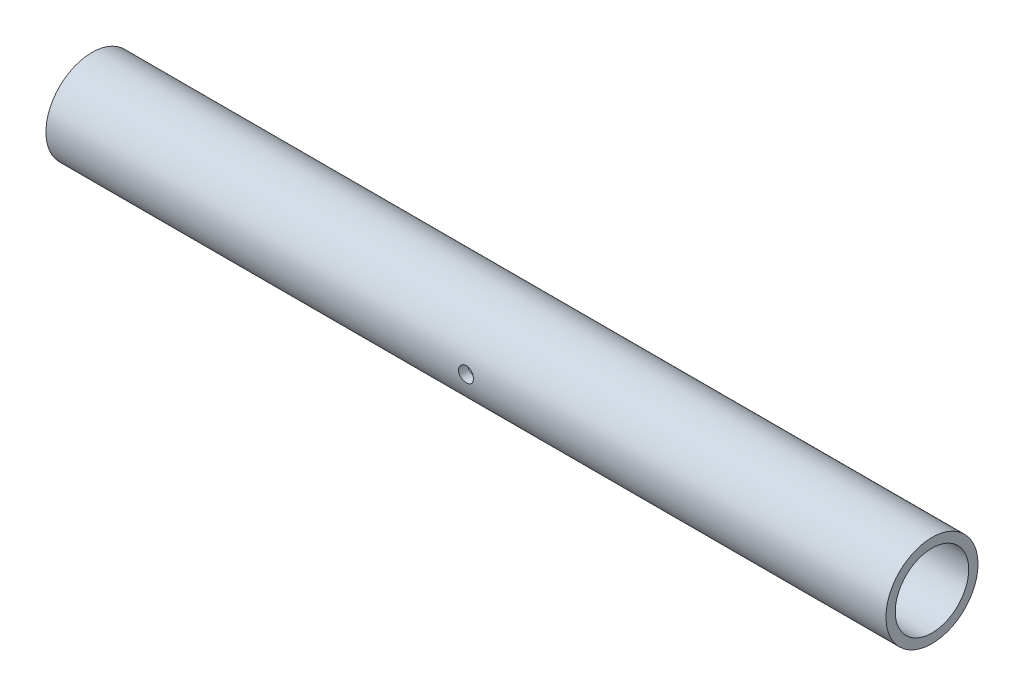
ISO-10303-21;
HEADER;
FILE_DESCRIPTION(('STEP AP214'),'2;1');
FILE_NAME('part.step','',(''),(''),'','','');
FILE_SCHEMA(('AUTOMOTIVE_DESIGN { 1 0 10303 214 1 1 1 1 }'));
ENDSEC;
DATA;
#1=APPLICATION_CONTEXT('core data for automotive mechanical design processes');
#2=APPLICATION_PROTOCOL_DEFINITION('international standard','automotive_design',2000,#1);
#3=PRODUCT_CONTEXT('',#1,'mechanical');
#4=PRODUCT('Part','Part','',(#3));
#5=PRODUCT_RELATED_PRODUCT_CATEGORY('part','',(#4));
#6=PRODUCT_DEFINITION_FORMATION('','',#4);
#7=PRODUCT_DEFINITION_CONTEXT('part definition',#1,'design');
#8=PRODUCT_DEFINITION('design','',#6,#7);
#9=PRODUCT_DEFINITION_SHAPE('','',#8);
#10=(LENGTH_UNIT() NAMED_UNIT(*) SI_UNIT(.MILLI.,.METRE.));
#11=(NAMED_UNIT(*) PLANE_ANGLE_UNIT() SI_UNIT($,.RADIAN.));
#12=(NAMED_UNIT(*) SI_UNIT($,.STERADIAN.) SOLID_ANGLE_UNIT());
#13=UNCERTAINTY_MEASURE_WITH_UNIT(LENGTH_MEASURE(1.E-05),#10,'distance_accuracy_value','');
#14=(GEOMETRIC_REPRESENTATION_CONTEXT(3) GLOBAL_UNCERTAINTY_ASSIGNED_CONTEXT((#13)) GLOBAL_UNIT_ASSIGNED_CONTEXT((#10,
#11,#12)) REPRESENTATION_CONTEXT('',''));
#15=CARTESIAN_POINT('',(0.,0.,0.));
#16=DIRECTION('',(0.,0.,1.));
#17=DIRECTION('',(1.,0.,0.));
#18=AXIS2_PLACEMENT_3D('',#15,#16,#17);
#19=CARTESIAN_POINT('',(304.8,0.,0.));
#20=DIRECTION('',(1.,0.,0.));
#21=DIRECTION('',(0.,0.,-1.));
#22=AXIS2_PLACEMENT_3D('',#19,#20,#21);
#23=PLANE('',#22);
#24=CARTESIAN_POINT('',(304.8,0.,0.));
#25=DIRECTION('',(1.,0.,0.));
#26=DIRECTION('',(0.,0.,-1.));
#27=AXIS2_PLACEMENT_3D('',#24,#25,#26);
#28=CIRCLE('',#27,16.7005);
#29=CARTESIAN_POINT('',(304.8,0.,-16.7005));
#30=VERTEX_POINT('',#29);
#31=EDGE_CURVE('E10',#30,#30,#28,.T.);
#32=ORIENTED_EDGE('',*,*,#31,.T.);
#33=EDGE_LOOP('',(#32));
#34=FACE_BOUND('',#33,.T.);
#35=CARTESIAN_POINT('',(304.8,0.,0.));
#36=DIRECTION('',(1.,0.,0.));
#37=DIRECTION('',(0.,0.,-1.));
#38=AXIS2_PLACEMENT_3D('',#35,#36,#37);
#39=CIRCLE('',#38,13.335);
#40=CARTESIAN_POINT('',(304.8,0.,-13.335));
#41=VERTEX_POINT('',#40);
#42=EDGE_CURVE('E45',#41,#41,#39,.T.);
#43=ORIENTED_EDGE('',*,*,#42,.F.);
#44=EDGE_LOOP('',(#43));
#45=FACE_BOUND('',#44,.T.);
#46=ADVANCED_FACE('F33',(#34,#45),#23,.T.);
#47=CARTESIAN_POINT('',(0.,0.,0.));
#48=DIRECTION('',(1.,0.,0.));
#49=DIRECTION('',(0.,0.,-1.));
#50=AXIS2_PLACEMENT_3D('',#47,#48,#49);
#51=PLANE('',#50);
#52=CARTESIAN_POINT('',(0.,0.,0.));
#53=DIRECTION('',(1.,0.,0.));
#54=DIRECTION('',(0.,0.,-1.));
#55=AXIS2_PLACEMENT_3D('',#52,#53,#54);
#56=CIRCLE('',#55,16.7005);
#57=CARTESIAN_POINT('',(0.,0.,-16.7005));
#58=VERTEX_POINT('',#57);
#59=EDGE_CURVE('E38',#58,#58,#56,.T.);
#60=ORIENTED_EDGE('',*,*,#59,.F.);
#61=EDGE_LOOP('',(#60));
#62=FACE_BOUND('',#61,.T.);
#63=CARTESIAN_POINT('',(0.,0.,0.));
#64=DIRECTION('',(1.,0.,0.));
#65=DIRECTION('',(0.,0.,-1.));
#66=AXIS2_PLACEMENT_3D('',#63,#64,#65);
#67=CIRCLE('',#66,13.335);
#68=CARTESIAN_POINT('',(0.,0.,-13.335));
#69=VERTEX_POINT('',#68);
#70=EDGE_CURVE('E47',#69,#69,#67,.T.);
#71=ORIENTED_EDGE('',*,*,#70,.T.);
#72=EDGE_LOOP('',(#71));
#73=FACE_BOUND('',#72,.T.);
#74=ADVANCED_FACE('F76',(#62,#73),#51,.F.);
#75=CARTESIAN_POINT('',(304.8,0.,0.));
#76=DIRECTION('',(-1.,0.,0.));
#77=DIRECTION('',(0.,0.,1.));
#78=AXIS2_PLACEMENT_3D('',#75,#76,#77);
#79=CYLINDRICAL_SURFACE('',#78,16.7005);
#80=CARTESIAN_POINT('',(155.1051,0.,16.7005));
#81=CARTESIAN_POINT('',(155.105093897087,-0.150888062548303,16.7004974577365));
#82=CARTESIAN_POINT('',(155.092432758379,-0.301859994666066,16.6984337641219));
#83=CARTESIAN_POINT('',(155.042141383676,-0.599573765303217,16.6903999723937));
#84=CARTESIAN_POINT('',(155.004487792628,-0.746311513080885,16.6844262204648));
#85=CARTESIAN_POINT('',(154.90537472287,-1.0312061766267,16.6692427211351));
#86=CARTESIAN_POINT('',(154.843934287842,-1.16936985436145,16.6600355629369));
#87=CARTESIAN_POINT('',(154.699040513581,-1.43340829062403,16.6393990707399));
#88=CARTESIAN_POINT('',(154.615589848481,-1.55928453946972,16.6279700067358));
#89=CARTESIAN_POINT('',(154.428240590823,-1.79633294529008,16.6040421740029));
#90=CARTESIAN_POINT('',(154.324181856033,-1.90737774983379,16.591535491026));
#91=CARTESIAN_POINT('',(154.098914989324,-2.1105114085896,16.5669229733114));
#92=CARTESIAN_POINT('',(153.977705804489,-2.20259909811607,16.5548171632407));
#93=CARTESIAN_POINT('',(153.720709403468,-2.36571066174806,16.5323003820462));
#94=CARTESIAN_POINT('',(153.58484178218,-2.43660938550688,16.521899638475));
#95=CARTESIAN_POINT('',(153.302929431016,-2.55453030416696,16.5040799174436));
#96=CARTESIAN_POINT('',(153.156885350204,-2.60155402025599,16.4966607500196));
#97=CARTESIAN_POINT('',(152.860112716242,-2.66999048982907,16.4857227198729));
#98=CARTESIAN_POINT('',(152.709435998324,-2.69162258951269,16.4821704723586));
#99=CARTESIAN_POINT('',(152.406552768084,-2.70934168919743,16.4792673895096));
#100=CARTESIAN_POINT('',(152.254346358719,-2.70543039707,16.4799162732805));
#101=CARTESIAN_POINT('',(151.954285356396,-2.67235257585698,16.4853116422221));
#102=CARTESIAN_POINT('',(151.806402847489,-2.64343183378623,16.4900182476923));
#103=CARTESIAN_POINT('',(151.517617291042,-2.56154150799834,16.502936357017));
#104=CARTESIAN_POINT('',(151.37671447089,-2.50857114134623,16.5111479749766));
#105=CARTESIAN_POINT('',(151.105148697648,-2.37983413536215,16.5301942305314));
#106=CARTESIAN_POINT('',(150.974535269656,-2.30396483733819,16.5410406365502));
#107=CARTESIAN_POINT('',(150.727800002518,-2.13165657059765,16.5641260861383));
#108=CARTESIAN_POINT('',(150.611679270523,-2.03521603188844,16.5763652359683));
#109=CARTESIAN_POINT('',(150.395802387933,-1.82316079178855,16.6010326457947));
#110=CARTESIAN_POINT('',(150.296253457762,-1.70733507940944,16.6134614436807));
#111=CARTESIAN_POINT('',(150.117973519348,-1.46051261763989,16.6369752748997));
#112=CARTESIAN_POINT('',(150.039242631801,-1.32951578029888,16.6480603004418));
#113=CARTESIAN_POINT('',(149.904817203808,-1.05587919110396,16.6676520858549));
#114=CARTESIAN_POINT('',(149.849140292661,-0.913230628642439,16.6761568713015));
#115=CARTESIAN_POINT('',(149.762592033457,-0.620439017931161,16.689613888894));
#116=CARTESIAN_POINT('',(149.731718726758,-0.470296562439258,16.6945664015455));
#117=CARTESIAN_POINT('',(149.695933402982,-0.16856590589134,16.7003233068798));
#118=CARTESIAN_POINT('',(149.690736794805,-0.0170122941565777,16.7011731693918));
#119=CARTESIAN_POINT('',(149.705694623299,0.284800682339517,16.6987533332108));
#120=CARTESIAN_POINT('',(149.725848140432,0.435060093846976,16.6954837839433));
#121=CARTESIAN_POINT('',(149.79069743882,0.729145269491143,16.6852206333956));
#122=CARTESIAN_POINT('',(149.835252978216,0.873002765566383,16.6782483193063));
#123=CARTESIAN_POINT('',(149.947492520573,1.15120604540566,16.6613584524574));
#124=CARTESIAN_POINT('',(150.015177761857,1.28555131943812,16.6514407420105));
#125=CARTESIAN_POINT('',(150.172411794106,1.54215720864201,16.629647987126));
#126=CARTESIAN_POINT('',(150.262139161391,1.66430704194941,16.6177572269374));
#127=CARTESIAN_POINT('',(150.460663902427,1.89191696449165,16.5933865628871));
#128=CARTESIAN_POINT('',(150.569462579924,1.99737591177163,16.5809066187905));
#129=CARTESIAN_POINT('',(150.804315231753,2.18965975513515,16.5566179523259));
#130=CARTESIAN_POINT('',(150.93052720777,2.27629280016818,16.5448169671038));
#131=CARTESIAN_POINT('',(151.195879626388,2.42712761732702,16.5233646792845));
#132=CARTESIAN_POINT('',(151.335019675855,2.49133007126879,16.5137133113492));
#133=CARTESIAN_POINT('',(151.62173175804,2.59519124980596,16.4977104952734));
#134=CARTESIAN_POINT('',(151.769267861794,2.6349470586088,16.4913460103877));
#135=CARTESIAN_POINT('',(152.069034939324,2.68909299931143,16.4826042915982));
#136=CARTESIAN_POINT('',(152.221265528669,2.70348520265564,16.4802267320832));
#137=CARTESIAN_POINT('',(152.524185617428,2.70644008511556,16.4797415544371));
#138=CARTESIAN_POINT('',(152.674872177798,2.69530464320214,16.4815840317318));
#139=CARTESIAN_POINT('',(152.972198053532,2.64817138492831,16.4892222214147));
#140=CARTESIAN_POINT('',(153.118837379963,2.61217363655834,16.4950179229922));
#141=CARTESIAN_POINT('',(153.403799112764,2.51645069874717,16.5098910068696));
#142=CARTESIAN_POINT('',(153.542129961818,2.45675008128221,16.5189649898099));
#143=CARTESIAN_POINT('',(153.806861126234,2.31534678208125,16.5393757512933));
#144=CARTESIAN_POINT('',(153.933260903651,2.23364310891717,16.5507126317935));
#145=CARTESIAN_POINT('',(154.172069631771,2.0494698849786,16.5745306822589));
#146=CARTESIAN_POINT('',(154.284305840065,1.94677779193518,16.5870232561983));
#147=CARTESIAN_POINT('',(154.490057277457,1.72401256578686,16.6116529092408));
#148=CARTESIAN_POINT('',(154.583568172536,1.60393541992531,16.6237899054911));
#149=CARTESIAN_POINT('',(154.749765732965,1.34888505958874,16.6464318057398));
#150=CARTESIAN_POINT('',(154.822313353884,1.21382025362174,16.6569256097812));
#151=CARTESIAN_POINT('',(154.943580335504,0.933308987477759,16.6749905845962));
#152=CARTESIAN_POINT('',(154.992323705429,0.787873158058099,16.6825646985689));
#153=CARTESIAN_POINT('',(155.053878589069,0.534871671086589,16.6922617563775));
#154=CARTESIAN_POINT('',(155.073056270392,0.428846028496355,16.6953347747841));
#155=CARTESIAN_POINT('',(155.098669052378,0.215227800139453,16.6994547874161));
#156=CARTESIAN_POINT('',(155.105104353482,0.107635239047601,16.7005018135109));
#157=CARTESIAN_POINT('',(155.1051,0.,16.7005));
#158=B_SPLINE_CURVE_WITH_KNOTS('',3,(#80,#81,#82,#83,#84,#85,#86,#87,#88,#89,#90,#91,#92,#93,
#94,#95,#96,#97,#98,#99,#100,#101,#102,#103,#104,#105,#106,#107,#108,#109,#110,#111,#112,#113,
#114,#115,#116,#117,#118,#119,#120,#121,#122,#123,#124,#125,#126,#127,#128,#129,#130,#131,#132,
#133,#134,#135,#136,#137,#138,#139,#140,#141,#142,#143,#144,#145,#146,#147,#148,#149,#150,#151,
#152,#153,#154,#155,#156,#157),.UNSPECIFIED.,.T.,.F.,(4,2,2,2,2,2,2,2,2,2,2,2,2,2,2,2,2,2,2,2,2,
2,2,2,2,2,2,2,2,2,2,2,2,2,2,2,2,2,4),(0.,0.452270787216408,0.904964810512096,1.35729715518357,
1.80957456901735,2.26551517452944,2.72148378372722,3.18009458772586,3.63867616782943,
4.09326642255645,4.54782628297365,4.9979689596137,5.44812629168908,5.90033249063431,
6.35257321421474,6.81010181368963,7.26763306569815,7.7255135470429,8.18335786781695,
8.63611604666351,9.08885780285638,9.53902448404456,9.98921527009213,10.4431811075173,
10.8971779909038,11.3556045004122,11.8140170740548,12.2705972081985,12.7271400517363,
13.1783119065942,13.6294825276468,14.0801866512621,14.5309110863978,14.9866887137601,
15.4425717103213,15.9014124875041,16.3597895122137,16.6824196742317,17.0050447611613),.UNSPECIFIED.);
#159=CARTESIAN_POINT('',(155.1051,0.,16.7005));
#160=VERTEX_POINT('',#159);
#161=EDGE_CURVE('E50',#160,#160,#158,.T.);
#162=ORIENTED_EDGE('',*,*,#161,.T.);
#163=EDGE_LOOP('',(#162));
#164=FACE_BOUND('',#163,.T.);
#165=ORIENTED_EDGE('',*,*,#31,.F.);
#166=EDGE_LOOP('',(#165));
#167=FACE_BOUND('',#166,.T.);
#168=ORIENTED_EDGE('',*,*,#59,.T.);
#169=EDGE_LOOP('',(#168));
#170=FACE_BOUND('',#169,.T.);
#171=ADVANCED_FACE('F35',(#164,#167,#170),#79,.T.);
#172=CARTESIAN_POINT('',(304.8,0.,0.));
#173=DIRECTION('',(-1.,0.,0.));
#174=DIRECTION('',(0.,0.,1.));
#175=AXIS2_PLACEMENT_3D('',#172,#173,#174);
#176=CYLINDRICAL_SURFACE('',#175,13.335);
#177=CARTESIAN_POINT('',(155.1051,0.,13.335));
#178=CARTESIAN_POINT('',(155.105094525376,-0.150295600484553,13.3349972242289));
#179=CARTESIAN_POINT('',(155.092532026992,-0.300659946654723,13.3324330403292));
#180=CARTESIAN_POINT('',(155.0426556573,-0.597135385188636,13.3224513830455));
#181=CARTESIAN_POINT('',(155.00532241314,-0.743243055026255,13.3150301110628));
#182=CARTESIAN_POINT('',(154.907107787482,-1.02687601225216,13.296162618508));
#183=CARTESIAN_POINT('',(154.84624926408,-1.16440948049959,13.2847203059164));
#184=CARTESIAN_POINT('',(154.702780252209,-1.4273047577558,13.2590533011895));
#185=CARTESIAN_POINT('',(154.620170950095,-1.55266723009767,13.2448287608163));
#186=CARTESIAN_POINT('',(154.434327195231,-1.7894149071107,13.2149405065597));
#187=CARTESIAN_POINT('',(154.330848481905,-1.9006064034824,13.199261063324));
#188=CARTESIAN_POINT('',(154.106728265231,-2.10417816613857,13.168344071895));
#189=CARTESIAN_POINT('',(153.986085396097,-2.19655693403454,13.1531065589832));
#190=CARTESIAN_POINT('',(153.729662382321,-2.36070988620932,13.1246448707219));
#191=CARTESIAN_POINT('',(153.593750860226,-2.43228266379821,13.1114409219455));
#192=CARTESIAN_POINT('',(153.311518766293,-2.55150142471515,13.0887651113974));
#193=CARTESIAN_POINT('',(153.165199255873,-2.59914984389556,13.0792928697041));
#194=CARTESIAN_POINT('',(152.868391357684,-2.6685367944566,13.0653122596412));
#195=CARTESIAN_POINT('',(152.717985662028,-2.69061565322798,13.0607387529412));
#196=CARTESIAN_POINT('',(152.415540625344,-2.70929399940926,13.0568774442569));
#197=CARTESIAN_POINT('',(152.263501457958,-2.70589616880503,13.0575890858936));
#198=CARTESIAN_POINT('',(151.964601070229,-2.67399255726,13.0641585153922));
#199=CARTESIAN_POINT('',(151.817696102583,-2.64587767366682,13.0699361809375));
#200=CARTESIAN_POINT('',(151.530732268451,-2.56595538643003,13.0858604269536));
#201=CARTESIAN_POINT('',(151.390673737762,-2.51414682197339,13.0960072214775));
#202=CARTESIAN_POINT('',(151.120256078371,-2.38793669722346,13.1196079166759));
#203=CARTESIAN_POINT('',(150.989970984035,-2.31338088418128,13.1330842731062));
#204=CARTESIAN_POINT('',(150.74361439873,-2.14390140848478,13.1618113260375));
#205=CARTESIAN_POINT('',(150.627544588842,-2.04897534051733,13.1770622319794));
#206=CARTESIAN_POINT('',(150.410658529072,-1.83936052489874,13.207966610656));
#207=CARTESIAN_POINT('',(150.310164588826,-1.72433832876226,13.2236223079897));
#208=CARTESIAN_POINT('',(150.129845547073,-1.47890259644831,13.2533138361505));
#209=CARTESIAN_POINT('',(150.050020725472,-1.34848885186894,13.2673496450393));
#210=CARTESIAN_POINT('',(149.913243309945,-1.07560877370192,13.2922559746792));
#211=CARTESIAN_POINT('',(149.856328351573,-0.9331230696536,13.3031212790442));
#212=CARTESIAN_POINT('',(149.767334173484,-0.640342655170266,13.3204229182029));
#213=CARTESIAN_POINT('',(149.735251857011,-0.490048920930976,13.3268598052313));
#214=CARTESIAN_POINT('',(149.697291809661,-0.188687712334038,13.3345021896925));
#215=CARTESIAN_POINT('',(149.69097311446,-0.037677946869132,13.3357957101814));
#216=CARTESIAN_POINT('',(149.703530978531,0.263239556156422,13.3332504287549));
#217=CARTESIAN_POINT('',(149.722406078805,0.413147357027401,13.32941192404));
#218=CARTESIAN_POINT('',(149.784449478553,0.706177355722136,13.3170890419464));
#219=CARTESIAN_POINT('',(149.827390777664,0.849349603396196,13.3086480961947));
#220=CARTESIAN_POINT('',(149.936098999973,1.12646132397948,13.2880635649464));
#221=CARTESIAN_POINT('',(150.001867669613,1.26040008952707,13.2759196961607));
#222=CARTESIAN_POINT('',(150.1553124641,1.51709720534946,13.249057435921));
#223=CARTESIAN_POINT('',(150.243253128819,1.63969417441024,13.234308651375));
#224=CARTESIAN_POINT('',(150.438192261469,1.86854925612131,13.2039425775509));
#225=CARTESIAN_POINT('',(150.545192835727,1.97480556053181,13.1883251924146));
#226=CARTESIAN_POINT('',(150.777224325758,2.16967113581846,13.1576842969314));
#227=CARTESIAN_POINT('',(150.902511858808,2.2579772780275,13.1426739537023));
#228=CARTESIAN_POINT('',(151.166400440108,2.41229295069217,13.1152291615274));
#229=CARTESIAN_POINT('',(151.305000947602,2.47830338628301,13.1027946080206));
#230=CARTESIAN_POINT('',(151.590874470357,2.58574384042946,13.0820163622959));
#231=CARTESIAN_POINT('',(151.738097250659,2.62730316903986,13.0736511905723));
#232=CARTESIAN_POINT('',(152.037624714809,2.68505210426675,13.0619142618958));
#233=CARTESIAN_POINT('',(152.189928711529,2.70124512705367,13.058541832556));
#234=CARTESIAN_POINT('',(152.492249983923,2.70767252503984,13.0572103103202));
#235=CARTESIAN_POINT('',(152.642256835453,2.69838611838186,13.0591512812084));
#236=CARTESIAN_POINT('',(152.938522306478,2.65517792546284,13.0680041721845));
#237=CARTESIAN_POINT('',(153.084780958013,2.62125634986901,13.0749160497637));
#238=CARTESIAN_POINT('',(153.369082210092,2.52995717578002,13.0928866727968));
#239=CARTESIAN_POINT('',(153.507144922099,2.47263996377305,13.1039347363055));
#240=CARTESIAN_POINT('',(153.771768617197,2.33623222267459,13.1289386922158));
#241=CARTESIAN_POINT('',(153.898328599311,2.25713980109381,13.1428948373339));
#242=CARTESIAN_POINT('',(154.138737028366,2.07779697949024,13.1724471666242));
#243=CARTESIAN_POINT('',(154.252324843556,1.97720115843756,13.188067738479));
#244=CARTESIAN_POINT('',(154.461166037052,1.75841835754841,13.2190155313656));
#245=CARTESIAN_POINT('',(154.556415194048,1.64022733861366,13.2343426841269));
#246=CARTESIAN_POINT('',(154.726850865077,1.38807123157175,13.2631724688158));
#247=CARTESIAN_POINT('',(154.801809092012,1.25394927014427,13.276653559364));
#248=CARTESIAN_POINT('',(154.928003538366,0.974774923026418,13.3000597177516));
#249=CARTESIAN_POINT('',(154.97926092306,0.829732424717033,13.3099879565525));
#250=CARTESIAN_POINT('',(155.046787117943,0.570324604330927,13.3232639467522));
#251=CARTESIAN_POINT('',(155.068615067119,0.45742586083621,13.327638992893));
#252=CARTESIAN_POINT('',(155.097773357139,0.22969808726299,13.3335080319502));
#253=CARTESIAN_POINT('',(155.10510418419,0.114869122050805,13.3350021214885));
#254=CARTESIAN_POINT('',(155.1051,0.,13.335));
#255=B_SPLINE_CURVE_WITH_KNOTS('',3,(#177,#178,#179,#180,#181,#182,#183,#184,#185,#186,#187,
#188,#189,#190,#191,#192,#193,#194,#195,#196,#197,#198,#199,#200,#201,#202,#203,#204,#205,#206,
#207,#208,#209,#210,#211,#212,#213,#214,#215,#216,#217,#218,#219,#220,#221,#222,#223,#224,#225,
#226,#227,#228,#229,#230,#231,#232,#233,#234,#235,#236,#237,#238,#239,#240,#241,#242,#243,#244,
#245,#246,#247,#248,#249,#250,#251,#252,#253,#254),.UNSPECIFIED.,.T.,.F.,(4,2,2,2,2,2,2,2,2,2,2,
2,2,2,2,2,2,2,2,2,2,2,2,2,2,2,2,2,2,2,2,2,2,2,2,2,2,2,4),(0.,0.450466540959125,
0.901285801401294,1.35166812455106,1.80202588755751,2.25799744724725,2.71400530978153,
3.17429068540293,3.63452918768033,4.0885689020244,4.54256081930287,4.98949951624589,
5.43646011218639,5.88652164703375,6.33663635427288,6.79508725203935,7.25354435795345,
7.71275155793441,8.1719014832478,8.62315884642445,9.07439007798768,9.52143509257741,
9.96851431656822,10.4212035028349,10.8739427471937,11.3337873895974,11.7936133615181,
12.2509851539842,12.7082953452709,13.1570636849492,13.6058281870383,14.0534416345438,
14.501093996541,14.9565651472641,15.4121410161987,15.8726474155708,16.3327417764777,
16.677039489884,17.0213256559887),.UNSPECIFIED.);
#256=CARTESIAN_POINT('',(155.1051,0.,13.335));
#257=VERTEX_POINT('',#256);
#258=EDGE_CURVE('E59',#257,#257,#255,.T.);
#259=ORIENTED_EDGE('',*,*,#258,.F.);
#260=EDGE_LOOP('',(#259));
#261=FACE_BOUND('',#260,.T.);
#262=ORIENTED_EDGE('',*,*,#42,.T.);
#263=EDGE_LOOP('',(#262));
#264=FACE_BOUND('',#263,.T.);
#265=ORIENTED_EDGE('',*,*,#70,.F.);
#266=EDGE_LOOP('',(#265));
#267=FACE_BOUND('',#266,.T.);
#268=ADVANCED_FACE('F67',(#261,#264,#267),#176,.F.);
#269=CARTESIAN_POINT('',(152.4,0.,16.7005));
#270=DIRECTION('',(0.,0.,1.));
#271=DIRECTION('',(1.,0.,0.));
#272=AXIS2_PLACEMENT_3D('',#269,#270,#271);
#273=CYLINDRICAL_SURFACE('',#272,2.70509999999999);
#274=ORIENTED_EDGE('',*,*,#258,.T.);
#275=EDGE_LOOP('',(#274));
#276=FACE_BOUND('',#275,.T.);
#277=ORIENTED_EDGE('',*,*,#161,.F.);
#278=EDGE_LOOP('',(#277));
#279=FACE_BOUND('',#278,.T.);
#280=ADVANCED_FACE('F64',(#276,#279),#273,.F.);
#281=CLOSED_SHELL('',(#46,#74,#171,#268,#280));
#282=MANIFOLD_SOLID_BREP('B2',#281);
#283=ADVANCED_BREP_SHAPE_REPRESENTATION('',(#18,#282),#14);
#284=SHAPE_DEFINITION_REPRESENTATION(#9,#283);
ENDSEC;
END-ISO-10303-21;
